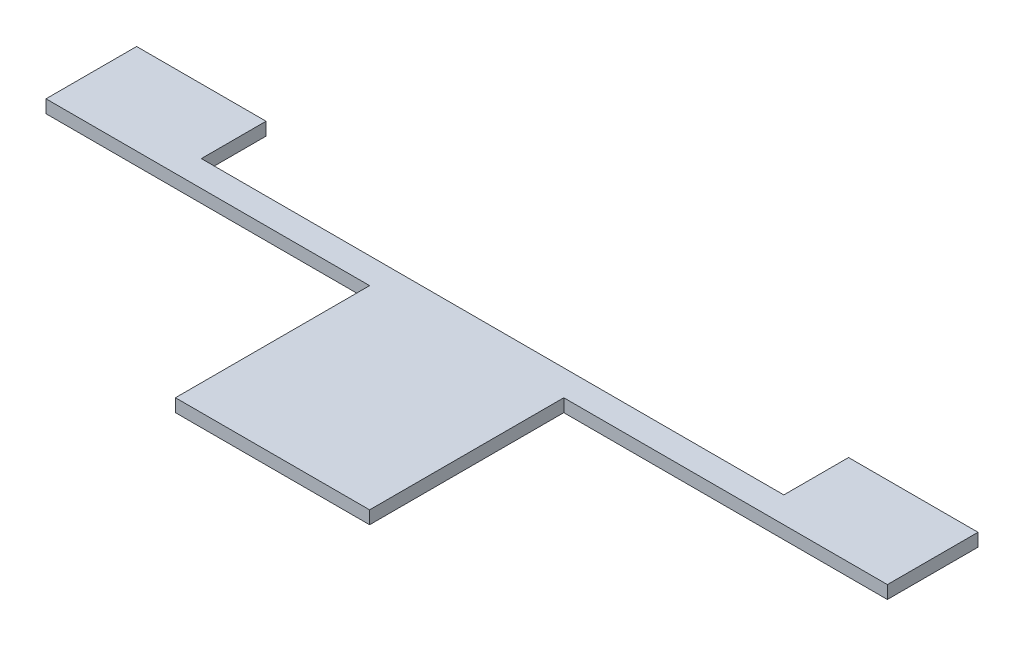
ISO-10303-21;
HEADER;
FILE_DESCRIPTION(('STEP AP214'),'2;1');
FILE_NAME('part.step','',(''),(''),'','','');
FILE_SCHEMA(('AUTOMOTIVE_DESIGN { 1 0 10303 214 1 1 1 1 }'));
ENDSEC;
DATA;
#1=APPLICATION_CONTEXT('core data for automotive mechanical design processes');
#2=APPLICATION_PROTOCOL_DEFINITION('international standard','automotive_design',2000,#1);
#3=PRODUCT_CONTEXT('',#1,'mechanical');
#4=PRODUCT('Part','Part','',(#3));
#5=PRODUCT_RELATED_PRODUCT_CATEGORY('part','',(#4));
#6=PRODUCT_DEFINITION_FORMATION('','',#4);
#7=PRODUCT_DEFINITION_CONTEXT('part definition',#1,'design');
#8=PRODUCT_DEFINITION('design','',#6,#7);
#9=PRODUCT_DEFINITION_SHAPE('','',#8);
#10=(LENGTH_UNIT() NAMED_UNIT(*) SI_UNIT(.MILLI.,.METRE.));
#11=(NAMED_UNIT(*) PLANE_ANGLE_UNIT() SI_UNIT($,.RADIAN.));
#12=(NAMED_UNIT(*) SI_UNIT($,.STERADIAN.) SOLID_ANGLE_UNIT());
#13=UNCERTAINTY_MEASURE_WITH_UNIT(LENGTH_MEASURE(1.E-05),#10,'distance_accuracy_value','');
#14=(GEOMETRIC_REPRESENTATION_CONTEXT(3) GLOBAL_UNCERTAINTY_ASSIGNED_CONTEXT((#13)) GLOBAL_UNIT_ASSIGNED_CONTEXT((#10,
#11,#12)) REPRESENTATION_CONTEXT('',''));
#15=CARTESIAN_POINT('',(0.,0.,0.));
#16=DIRECTION('',(0.,0.,1.));
#17=DIRECTION('',(1.,0.,0.));
#18=AXIS2_PLACEMENT_3D('',#15,#16,#17);
#19=CARTESIAN_POINT('',(31.4016749755807,2.,0.));
#20=DIRECTION('',(-1.,0.,0.));
#21=DIRECTION('',(0.,0.,1.));
#22=AXIS2_PLACEMENT_3D('',#19,#20,#21);
#23=PLANE('',#22);
#24=DIRECTION('',(0.,0.,-1.));
#25=VECTOR('',#24,1.);
#26=CARTESIAN_POINT('',(31.4016749755807,0.,0.));
#27=LINE('',#26,#25);
#28=CARTESIAN_POINT('',(31.4016749755807,0.,-27.8626315789474));
#29=VERTEX_POINT('',#28);
#30=CARTESIAN_POINT('',(31.4016749755807,0.,-37.8626315789474));
#31=VERTEX_POINT('',#30);
#32=EDGE_CURVE('E159',#29,#31,#27,.T.);
#33=ORIENTED_EDGE('',*,*,#32,.F.);
#34=DIRECTION('',(0.,-1.,0.));
#35=VECTOR('',#34,1.);
#36=CARTESIAN_POINT('',(31.4016749755807,2.,-27.8626315789474));
#37=LINE('',#36,#35);
#38=CARTESIAN_POINT('',(31.4016749755807,2.,-27.8626315789474));
#39=VERTEX_POINT('',#38);
#40=EDGE_CURVE('E11',#39,#29,#37,.T.);
#41=ORIENTED_EDGE('',*,*,#40,.F.);
#42=DIRECTION('',(0.,0.,-1.));
#43=VECTOR('',#42,1.);
#44=CARTESIAN_POINT('',(31.4016749755807,2.,0.));
#45=LINE('',#44,#43);
#46=CARTESIAN_POINT('',(31.4016749755807,2.,-37.8626315789474));
#47=VERTEX_POINT('',#46);
#48=EDGE_CURVE('E226',#39,#47,#45,.T.);
#49=ORIENTED_EDGE('',*,*,#48,.T.);
#50=DIRECTION('',(0.,-1.,0.));
#51=VECTOR('',#50,1.);
#52=CARTESIAN_POINT('',(31.4016749755807,2.,-37.8626315789474));
#53=LINE('',#52,#51);
#54=EDGE_CURVE('E55',#47,#31,#53,.T.);
#55=ORIENTED_EDGE('',*,*,#54,.T.);
#56=EDGE_LOOP('',(#33,#41,#49,#55));
#57=FACE_BOUND('',#56,.T.);
#58=ADVANCED_FACE('F39',(#57),#23,.T.);
#59=CARTESIAN_POINT('',(0.,2.,-27.8626315789474));
#60=DIRECTION('',(0.,0.,-1.));
#61=DIRECTION('',(-1.,0.,0.));
#62=AXIS2_PLACEMENT_3D('',#59,#60,#61);
#63=PLANE('',#62);
#64=DIRECTION('',(1.,0.,0.));
#65=VECTOR('',#64,1.);
#66=CARTESIAN_POINT('',(0.,0.,-27.8626315789474));
#67=LINE('',#66,#65);
#68=CARTESIAN_POINT('',(-58.5983250244193,0.,-27.8626315789474));
#69=VERTEX_POINT('',#68);
#70=EDGE_CURVE('E161',#69,#29,#67,.T.);
#71=ORIENTED_EDGE('',*,*,#70,.F.);
#72=DIRECTION('',(0.,-1.,0.));
#73=VECTOR('',#72,1.);
#74=CARTESIAN_POINT('',(-58.5983250244193,2.,-27.8626315789474));
#75=LINE('',#74,#73);
#76=CARTESIAN_POINT('',(-58.5983250244193,2.,-27.8626315789474));
#77=VERTEX_POINT('',#76);
#78=EDGE_CURVE('E47',#77,#69,#75,.T.);
#79=ORIENTED_EDGE('',*,*,#78,.F.);
#80=DIRECTION('',(1.,0.,0.));
#81=VECTOR('',#80,1.);
#82=CARTESIAN_POINT('',(0.,2.,-27.8626315789474));
#83=LINE('',#82,#81);
#84=EDGE_CURVE('E223',#77,#39,#83,.T.);
#85=ORIENTED_EDGE('',*,*,#84,.T.);
#86=ORIENTED_EDGE('',*,*,#40,.T.);
#87=EDGE_LOOP('',(#71,#79,#85,#86));
#88=FACE_BOUND('',#87,.T.);
#89=ADVANCED_FACE('F211',(#88),#63,.T.);
#90=CARTESIAN_POINT('',(-58.5983250244193,2.,0.));
#91=DIRECTION('',(1.,0.,0.));
#92=DIRECTION('',(0.,0.,-1.));
#93=AXIS2_PLACEMENT_3D('',#90,#91,#92);
#94=PLANE('',#93);
#95=DIRECTION('',(0.,0.,1.));
#96=VECTOR('',#95,1.);
#97=CARTESIAN_POINT('',(-58.5983250244193,0.,0.));
#98=LINE('',#97,#96);
#99=CARTESIAN_POINT('',(-58.5983250244193,0.,-37.8626315789474));
#100=VERTEX_POINT('',#99);
#101=EDGE_CURVE('E164',#100,#69,#98,.T.);
#102=ORIENTED_EDGE('',*,*,#101,.F.);
#103=DIRECTION('',(0.,-1.,0.));
#104=VECTOR('',#103,1.);
#105=CARTESIAN_POINT('',(-58.5983250244193,2.,-37.8626315789474));
#106=LINE('',#105,#104);
#107=CARTESIAN_POINT('',(-58.5983250244193,2.,-37.8626315789474));
#108=VERTEX_POINT('',#107);
#109=EDGE_CURVE('E200',#108,#100,#106,.T.);
#110=ORIENTED_EDGE('',*,*,#109,.F.);
#111=DIRECTION('',(0.,0.,1.));
#112=VECTOR('',#111,1.);
#113=CARTESIAN_POINT('',(-58.5983250244193,2.,0.));
#114=LINE('',#113,#112);
#115=EDGE_CURVE('E207',#108,#77,#114,.T.);
#116=ORIENTED_EDGE('',*,*,#115,.T.);
#117=ORIENTED_EDGE('',*,*,#78,.T.);
#118=EDGE_LOOP('',(#102,#110,#116,#117));
#119=FACE_BOUND('',#118,.T.);
#120=ADVANCED_FACE('F205',(#119),#94,.T.);
#121=CARTESIAN_POINT('',(0.,2.,-37.8626315789474));
#122=DIRECTION('',(0.,0.,-1.));
#123=DIRECTION('',(-1.,0.,0.));
#124=AXIS2_PLACEMENT_3D('',#121,#122,#123);
#125=PLANE('',#124);
#126=DIRECTION('',(1.,0.,0.));
#127=VECTOR('',#126,1.);
#128=CARTESIAN_POINT('',(0.,0.,-37.8626315789474));
#129=LINE('',#128,#127);
#130=CARTESIAN_POINT('',(-78.5983250244193,0.,-37.8626315789474));
#131=VERTEX_POINT('',#130);
#132=EDGE_CURVE('E167',#131,#100,#129,.T.);
#133=ORIENTED_EDGE('',*,*,#132,.F.);
#134=DIRECTION('',(0.,-1.,0.));
#135=VECTOR('',#134,1.);
#136=CARTESIAN_POINT('',(-78.5983250244193,2.,-37.8626315789474));
#137=LINE('',#136,#135);
#138=CARTESIAN_POINT('',(-78.5983250244193,2.,-37.8626315789474));
#139=VERTEX_POINT('',#138);
#140=EDGE_CURVE('E198',#139,#131,#137,.T.);
#141=ORIENTED_EDGE('',*,*,#140,.F.);
#142=DIRECTION('',(1.,0.,0.));
#143=VECTOR('',#142,1.);
#144=CARTESIAN_POINT('',(0.,2.,-37.8626315789474));
#145=LINE('',#144,#143);
#146=EDGE_CURVE('E155',#139,#108,#145,.T.);
#147=ORIENTED_EDGE('',*,*,#146,.T.);
#148=ORIENTED_EDGE('',*,*,#109,.T.);
#149=EDGE_LOOP('',(#133,#141,#147,#148));
#150=FACE_BOUND('',#149,.T.);
#151=ADVANCED_FACE('F218',(#150),#125,.T.);
#152=CARTESIAN_POINT('',(-78.5983250244193,2.,0.));
#153=DIRECTION('',(-1.,0.,0.));
#154=DIRECTION('',(0.,0.,1.));
#155=AXIS2_PLACEMENT_3D('',#152,#153,#154);
#156=PLANE('',#155);
#157=DIRECTION('',(0.,0.,-1.));
#158=VECTOR('',#157,1.);
#159=CARTESIAN_POINT('',(-78.5983250244193,0.,0.));
#160=LINE('',#159,#158);
#161=CARTESIAN_POINT('',(-78.5983250244193,0.,-23.8626315789474));
#162=VERTEX_POINT('',#161);
#163=EDGE_CURVE('E170',#162,#131,#160,.T.);
#164=ORIENTED_EDGE('',*,*,#163,.F.);
#165=DIRECTION('',(0.,-1.,0.));
#166=VECTOR('',#165,1.);
#167=CARTESIAN_POINT('',(-78.5983250244193,2.,-23.8626315789474));
#168=LINE('',#167,#166);
#169=CARTESIAN_POINT('',(-78.5983250244193,2.,-23.8626315789474));
#170=VERTEX_POINT('',#169);
#171=EDGE_CURVE('E196',#170,#162,#168,.T.);
#172=ORIENTED_EDGE('',*,*,#171,.F.);
#173=DIRECTION('',(0.,0.,-1.));
#174=VECTOR('',#173,1.);
#175=CARTESIAN_POINT('',(-78.5983250244193,2.,0.));
#176=LINE('',#175,#174);
#177=EDGE_CURVE('E225',#170,#139,#176,.T.);
#178=ORIENTED_EDGE('',*,*,#177,.T.);
#179=ORIENTED_EDGE('',*,*,#140,.T.);
#180=EDGE_LOOP('',(#164,#172,#178,#179));
#181=FACE_BOUND('',#180,.T.);
#182=ADVANCED_FACE('F255',(#181),#156,.T.);
#183=CARTESIAN_POINT('',(0.,2.,-23.8626315789474));
#184=DIRECTION('',(0.,0.,-1.));
#185=DIRECTION('',(-1.,0.,0.));
#186=AXIS2_PLACEMENT_3D('',#183,#184,#185);
#187=PLANE('',#186);
#188=DIRECTION('',(1.,0.,0.));
#189=VECTOR('',#188,1.);
#190=CARTESIAN_POINT('',(0.,0.,-23.8626315789474));
#191=LINE('',#190,#189);
#192=CARTESIAN_POINT('',(-28.5983250244193,0.,-23.8626315789474));
#193=VERTEX_POINT('',#192);
#194=EDGE_CURVE('E174',#162,#193,#191,.T.);
#195=ORIENTED_EDGE('',*,*,#194,.T.);
#196=DIRECTION('',(0.,-1.,0.));
#197=VECTOR('',#196,1.);
#198=CARTESIAN_POINT('',(-28.5983250244193,2.,-23.8626315789474));
#199=LINE('',#198,#197);
#200=CARTESIAN_POINT('',(-28.5983250244193,2.,-23.8626315789474));
#201=VERTEX_POINT('',#200);
#202=EDGE_CURVE('E193',#201,#193,#199,.T.);
#203=ORIENTED_EDGE('',*,*,#202,.F.);
#204=DIRECTION('',(1.,0.,0.));
#205=VECTOR('',#204,1.);
#206=CARTESIAN_POINT('',(0.,2.,-23.8626315789474));
#207=LINE('',#206,#205);
#208=EDGE_CURVE('E141',#170,#201,#207,.T.);
#209=ORIENTED_EDGE('',*,*,#208,.F.);
#210=ORIENTED_EDGE('',*,*,#171,.T.);
#211=EDGE_LOOP('',(#195,#203,#209,#210));
#212=FACE_BOUND('',#211,.T.);
#213=ADVANCED_FACE('F267',(#212),#187,.F.);
#214=CARTESIAN_POINT('',(-28.5983250244193,2.,0.));
#215=DIRECTION('',(1.,0.,0.));
#216=DIRECTION('',(0.,0.,-1.));
#217=AXIS2_PLACEMENT_3D('',#214,#215,#216);
#218=PLANE('',#217);
#219=DIRECTION('',(0.,0.,1.));
#220=VECTOR('',#219,1.);
#221=CARTESIAN_POINT('',(-28.5983250244193,0.,0.));
#222=LINE('',#221,#220);
#223=CARTESIAN_POINT('',(-28.5983250244193,0.,6.13736842105263));
#224=VERTEX_POINT('',#223);
#225=EDGE_CURVE('E176',#193,#224,#222,.T.);
#226=ORIENTED_EDGE('',*,*,#225,.T.);
#227=DIRECTION('',(0.,-1.,0.));
#228=VECTOR('',#227,1.);
#229=CARTESIAN_POINT('',(-28.5983250244193,2.,6.13736842105263));
#230=LINE('',#229,#228);
#231=CARTESIAN_POINT('',(-28.5983250244193,2.,6.13736842105263));
#232=VERTEX_POINT('',#231);
#233=EDGE_CURVE('E190',#232,#224,#230,.T.);
#234=ORIENTED_EDGE('',*,*,#233,.F.);
#235=DIRECTION('',(0.,0.,1.));
#236=VECTOR('',#235,1.);
#237=CARTESIAN_POINT('',(-28.5983250244193,2.,0.));
#238=LINE('',#237,#236);
#239=EDGE_CURVE('E231',#201,#232,#238,.T.);
#240=ORIENTED_EDGE('',*,*,#239,.F.);
#241=ORIENTED_EDGE('',*,*,#202,.T.);
#242=EDGE_LOOP('',(#226,#234,#240,#241));
#243=FACE_BOUND('',#242,.T.);
#244=ADVANCED_FACE('F269',(#243),#218,.F.);
#245=CARTESIAN_POINT('',(0.,2.,6.13736842105263));
#246=DIRECTION('',(0.,0.,-1.));
#247=DIRECTION('',(-1.,0.,0.));
#248=AXIS2_PLACEMENT_3D('',#245,#246,#247);
#249=PLANE('',#248);
#250=DIRECTION('',(1.,0.,0.));
#251=VECTOR('',#250,1.);
#252=CARTESIAN_POINT('',(0.,0.,6.13736842105263));
#253=LINE('',#252,#251);
#254=CARTESIAN_POINT('',(1.40167497558068,0.,6.13736842105263));
#255=VERTEX_POINT('',#254);
#256=EDGE_CURVE('E178',#224,#255,#253,.T.);
#257=ORIENTED_EDGE('',*,*,#256,.T.);
#258=DIRECTION('',(0.,-1.,0.));
#259=VECTOR('',#258,1.);
#260=CARTESIAN_POINT('',(1.40167497558068,2.,6.13736842105263));
#261=LINE('',#260,#259);
#262=CARTESIAN_POINT('',(1.40167497558068,2.,6.13736842105263));
#263=VERTEX_POINT('',#262);
#264=EDGE_CURVE('E187',#263,#255,#261,.T.);
#265=ORIENTED_EDGE('',*,*,#264,.F.);
#266=DIRECTION('',(1.,0.,0.));
#267=VECTOR('',#266,1.);
#268=CARTESIAN_POINT('',(0.,2.,6.13736842105263));
#269=LINE('',#268,#267);
#270=EDGE_CURVE('E232',#232,#263,#269,.T.);
#271=ORIENTED_EDGE('',*,*,#270,.F.);
#272=ORIENTED_EDGE('',*,*,#233,.T.);
#273=EDGE_LOOP('',(#257,#265,#271,#272));
#274=FACE_BOUND('',#273,.T.);
#275=ADVANCED_FACE('F238',(#274),#249,.F.);
#276=CARTESIAN_POINT('',(1.40167497558068,2.,0.));
#277=DIRECTION('',(-1.,0.,0.));
#278=DIRECTION('',(0.,0.,1.));
#279=AXIS2_PLACEMENT_3D('',#276,#277,#278);
#280=PLANE('',#279);
#281=DIRECTION('',(0.,0.,-1.));
#282=VECTOR('',#281,1.);
#283=CARTESIAN_POINT('',(1.40167497558068,0.,0.));
#284=LINE('',#283,#282);
#285=CARTESIAN_POINT('',(1.40167497558068,0.,-23.8626315789474));
#286=VERTEX_POINT('',#285);
#287=EDGE_CURVE('E180',#255,#286,#284,.T.);
#288=ORIENTED_EDGE('',*,*,#287,.T.);
#289=DIRECTION('',(0.,-1.,0.));
#290=VECTOR('',#289,1.);
#291=CARTESIAN_POINT('',(1.40167497558068,2.,-23.8626315789474));
#292=LINE('',#291,#290);
#293=CARTESIAN_POINT('',(1.40167497558068,2.,-23.8626315789474));
#294=VERTEX_POINT('',#293);
#295=EDGE_CURVE('E149',#294,#286,#292,.T.);
#296=ORIENTED_EDGE('',*,*,#295,.F.);
#297=DIRECTION('',(0.,0.,-1.));
#298=VECTOR('',#297,1.);
#299=CARTESIAN_POINT('',(1.40167497558068,2.,0.));
#300=LINE('',#299,#298);
#301=EDGE_CURVE('E136',#263,#294,#300,.T.);
#302=ORIENTED_EDGE('',*,*,#301,.F.);
#303=ORIENTED_EDGE('',*,*,#264,.T.);
#304=EDGE_LOOP('',(#288,#296,#302,#303));
#305=FACE_BOUND('',#304,.T.);
#306=ADVANCED_FACE('F242',(#305),#280,.F.);
#307=CARTESIAN_POINT('',(51.4016749755807,0.,-23.8626315789474));
#308=VERTEX_POINT('',#307);
#309=EDGE_CURVE('E146',#286,#308,#191,.T.);
#310=ORIENTED_EDGE('',*,*,#309,.T.);
#311=DIRECTION('',(0.,-1.,0.));
#312=VECTOR('',#311,1.);
#313=CARTESIAN_POINT('',(51.4016749755807,2.,-23.8626315789474));
#314=LINE('',#313,#312);
#315=CARTESIAN_POINT('',(51.4016749755807,2.,-23.8626315789474));
#316=VERTEX_POINT('',#315);
#317=EDGE_CURVE('E143',#316,#308,#314,.T.);
#318=ORIENTED_EDGE('',*,*,#317,.F.);
#319=EDGE_CURVE('E129',#294,#316,#207,.T.);
#320=ORIENTED_EDGE('',*,*,#319,.F.);
#321=ORIENTED_EDGE('',*,*,#295,.T.);
#322=EDGE_LOOP('',(#310,#318,#320,#321));
#323=FACE_BOUND('',#322,.T.);
#324=ADVANCED_FACE('F144',(#323),#187,.F.);
#325=CARTESIAN_POINT('',(51.4016749755807,2.,0.));
#326=DIRECTION('',(1.,0.,0.));
#327=DIRECTION('',(0.,0.,-1.));
#328=AXIS2_PLACEMENT_3D('',#325,#326,#327);
#329=PLANE('',#328);
#330=DIRECTION('',(0.,0.,1.));
#331=VECTOR('',#330,1.);
#332=CARTESIAN_POINT('',(51.4016749755807,0.,0.));
#333=LINE('',#332,#331);
#334=CARTESIAN_POINT('',(51.4016749755807,0.,-37.8626315789474));
#335=VERTEX_POINT('',#334);
#336=EDGE_CURVE('E182',#335,#308,#333,.T.);
#337=ORIENTED_EDGE('',*,*,#336,.F.);
#338=DIRECTION('',(0.,-1.,0.));
#339=VECTOR('',#338,1.);
#340=CARTESIAN_POINT('',(51.4016749755807,2.,-37.8626315789474));
#341=LINE('',#340,#339);
#342=CARTESIAN_POINT('',(51.4016749755807,2.,-37.8626315789474));
#343=VERTEX_POINT('',#342);
#344=EDGE_CURVE('E92',#343,#335,#341,.T.);
#345=ORIENTED_EDGE('',*,*,#344,.F.);
#346=DIRECTION('',(0.,0.,1.));
#347=VECTOR('',#346,1.);
#348=CARTESIAN_POINT('',(51.4016749755807,2.,0.));
#349=LINE('',#348,#347);
#350=EDGE_CURVE('E134',#343,#316,#349,.T.);
#351=ORIENTED_EDGE('',*,*,#350,.T.);
#352=ORIENTED_EDGE('',*,*,#317,.T.);
#353=EDGE_LOOP('',(#337,#345,#351,#352));
#354=FACE_BOUND('',#353,.T.);
#355=ADVANCED_FACE('F151',(#354),#329,.T.);
#356=EDGE_CURVE('E171',#31,#335,#129,.T.);
#357=ORIENTED_EDGE('',*,*,#356,.F.);
#358=ORIENTED_EDGE('',*,*,#54,.F.);
#359=EDGE_CURVE('E152',#47,#343,#145,.T.);
#360=ORIENTED_EDGE('',*,*,#359,.T.);
#361=ORIENTED_EDGE('',*,*,#344,.T.);
#362=EDGE_LOOP('',(#357,#358,#360,#361));
#363=FACE_BOUND('',#362,.T.);
#364=ADVANCED_FACE('F244',(#363),#125,.T.);
#365=CARTESIAN_POINT('',(0.,2.,0.));
#366=DIRECTION('',(0.,1.,0.));
#367=DIRECTION('',(0.,0.,1.));
#368=AXIS2_PLACEMENT_3D('',#365,#366,#367);
#369=PLANE('',#368);
#370=ORIENTED_EDGE('',*,*,#48,.F.);
#371=ORIENTED_EDGE('',*,*,#84,.F.);
#372=ORIENTED_EDGE('',*,*,#115,.F.);
#373=ORIENTED_EDGE('',*,*,#146,.F.);
#374=ORIENTED_EDGE('',*,*,#177,.F.);
#375=ORIENTED_EDGE('',*,*,#208,.T.);
#376=ORIENTED_EDGE('',*,*,#239,.T.);
#377=ORIENTED_EDGE('',*,*,#270,.T.);
#378=ORIENTED_EDGE('',*,*,#301,.T.);
#379=ORIENTED_EDGE('',*,*,#319,.T.);
#380=ORIENTED_EDGE('',*,*,#350,.F.);
#381=ORIENTED_EDGE('',*,*,#359,.F.);
#382=EDGE_LOOP('',(#370,#371,#372,#373,#374,#375,#376,#377,#378,#379,#380,#381));
#383=FACE_BOUND('',#382,.T.);
#384=ADVANCED_FACE('F131',(#383),#369,.T.);
#385=CARTESIAN_POINT('',(0.,0.,0.));
#386=DIRECTION('',(0.,1.,0.));
#387=DIRECTION('',(0.,0.,1.));
#388=AXIS2_PLACEMENT_3D('',#385,#386,#387);
#389=PLANE('',#388);
#390=ORIENTED_EDGE('',*,*,#32,.T.);
#391=ORIENTED_EDGE('',*,*,#356,.T.);
#392=ORIENTED_EDGE('',*,*,#336,.T.);
#393=ORIENTED_EDGE('',*,*,#309,.F.);
#394=ORIENTED_EDGE('',*,*,#287,.F.);
#395=ORIENTED_EDGE('',*,*,#256,.F.);
#396=ORIENTED_EDGE('',*,*,#225,.F.);
#397=ORIENTED_EDGE('',*,*,#194,.F.);
#398=ORIENTED_EDGE('',*,*,#163,.T.);
#399=ORIENTED_EDGE('',*,*,#132,.T.);
#400=ORIENTED_EDGE('',*,*,#101,.T.);
#401=ORIENTED_EDGE('',*,*,#70,.T.);
#402=EDGE_LOOP('',(#390,#391,#392,#393,#394,#395,#396,#397,#398,#399,#400,#401));
#403=FACE_BOUND('',#402,.T.);
#404=ADVANCED_FACE('F213',(#403),#389,.F.);
#405=CLOSED_SHELL('',(#58,#89,#120,#151,#182,#213,#244,#275,#306,#324,#355,#364,#384,#404));
#406=MANIFOLD_SOLID_BREP('B2',#405);
#407=ADVANCED_BREP_SHAPE_REPRESENTATION('',(#18,#406),#14);
#408=SHAPE_DEFINITION_REPRESENTATION(#9,#407);
ENDSEC;
END-ISO-10303-21;
